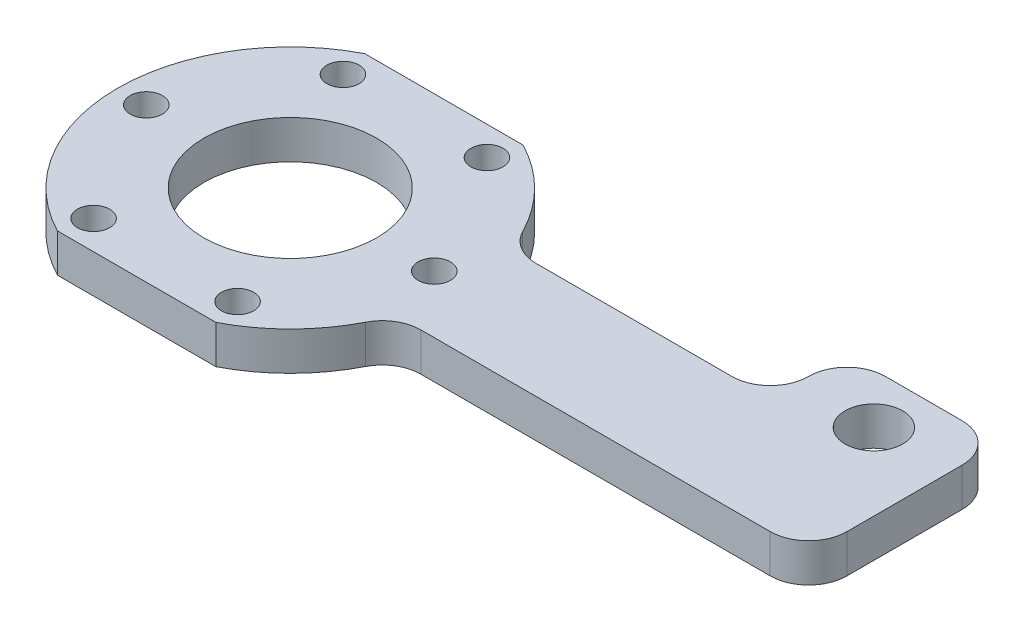
ISO-10303-21;
HEADER;
FILE_DESCRIPTION(('STEP AP214'),'2;1');
FILE_NAME('part.step','',(''),(''),'','','');
FILE_SCHEMA(('AUTOMOTIVE_DESIGN { 1 0 10303 214 1 1 1 1 }'));
ENDSEC;
DATA;
#1=APPLICATION_CONTEXT('core data for automotive mechanical design processes');
#2=APPLICATION_PROTOCOL_DEFINITION('international standard','automotive_design',2000,#1);
#3=PRODUCT_CONTEXT('',#1,'mechanical');
#4=PRODUCT('Part','Part','',(#3));
#5=PRODUCT_RELATED_PRODUCT_CATEGORY('part','',(#4));
#6=PRODUCT_DEFINITION_FORMATION('','',#4);
#7=PRODUCT_DEFINITION_CONTEXT('part definition',#1,'design');
#8=PRODUCT_DEFINITION('design','',#6,#7);
#9=PRODUCT_DEFINITION_SHAPE('','',#8);
#10=(LENGTH_UNIT() NAMED_UNIT(*) SI_UNIT(.MILLI.,.METRE.));
#11=(NAMED_UNIT(*) PLANE_ANGLE_UNIT() SI_UNIT($,.RADIAN.));
#12=(NAMED_UNIT(*) SI_UNIT($,.STERADIAN.) SOLID_ANGLE_UNIT());
#13=UNCERTAINTY_MEASURE_WITH_UNIT(LENGTH_MEASURE(1.E-05),#10,'distance_accuracy_value','');
#14=(GEOMETRIC_REPRESENTATION_CONTEXT(3) GLOBAL_UNCERTAINTY_ASSIGNED_CONTEXT((#13)) GLOBAL_UNIT_ASSIGNED_CONTEXT((#10,
#11,#12)) REPRESENTATION_CONTEXT('',''));
#15=CARTESIAN_POINT('',(0.,0.,0.));
#16=DIRECTION('',(0.,0.,1.));
#17=DIRECTION('',(1.,0.,0.));
#18=AXIS2_PLACEMENT_3D('',#15,#16,#17);
#19=CARTESIAN_POINT('',(0.,6.35,0.));
#20=DIRECTION('',(0.,-1.,0.));
#21=DIRECTION('',(0.,0.,-1.));
#22=AXIS2_PLACEMENT_3D('',#19,#20,#21);
#23=CYLINDRICAL_SURFACE('',#22,28.575);
#24=CARTESIAN_POINT('',(0.,6.35,0.));
#25=DIRECTION('',(0.,1.,0.));
#26=DIRECTION('',(0.,0.,1.));
#27=AXIS2_PLACEMENT_3D('',#24,#25,#26);
#28=CIRCLE('',#27,28.575);
#29=CARTESIAN_POINT('',(-13.0908603613361,6.35,-25.4));
#30=VERTEX_POINT('',#29);
#31=CARTESIAN_POINT('',(-13.0908603613368,6.35,25.3999999999996));
#32=VERTEX_POINT('',#31);
#33=EDGE_CURVE('E163',#30,#32,#28,.T.);
#34=ORIENTED_EDGE('',*,*,#33,.F.);
#35=DIRECTION('',(0.,-1.,0.));
#36=VECTOR('',#35,1.);
#37=CARTESIAN_POINT('',(-13.0908603613361,6.35,-25.4));
#38=LINE('',#37,#36);
#39=CARTESIAN_POINT('',(-13.0908603613361,0.,-25.4));
#40=VERTEX_POINT('',#39);
#41=EDGE_CURVE('E245',#30,#40,#38,.T.);
#42=ORIENTED_EDGE('',*,*,#41,.T.);
#43=CARTESIAN_POINT('',(0.,0.,0.));
#44=DIRECTION('',(0.,1.,0.));
#45=DIRECTION('',(0.,0.,1.));
#46=AXIS2_PLACEMENT_3D('',#43,#44,#45);
#47=CIRCLE('',#46,28.575);
#48=CARTESIAN_POINT('',(-13.0908603613368,0.,25.3999999999996));
#49=VERTEX_POINT('',#48);
#50=EDGE_CURVE('E174',#40,#49,#47,.T.);
#51=ORIENTED_EDGE('',*,*,#50,.T.);
#52=DIRECTION('',(0.,-1.,0.));
#53=VECTOR('',#52,1.);
#54=CARTESIAN_POINT('',(-13.0908603613368,6.35,25.3999999999996));
#55=LINE('',#54,#53);
#56=EDGE_CURVE('E53',#49,#32,#55,.F.);
#57=ORIENTED_EDGE('',*,*,#56,.T.);
#58=EDGE_LOOP('',(#34,#42,#51,#57));
#59=FACE_BOUND('',#58,.T.);
#60=ADVANCED_FACE('F38',(#59),#23,.T.);
#61=CARTESIAN_POINT('',(13.0908603613353,6.35,25.4000000000004));
#62=VERTEX_POINT('',#61);
#63=CARTESIAN_POINT('',(25.4524252363743,6.35,12.9886363636364));
#64=VERTEX_POINT('',#63);
#65=EDGE_CURVE('E160',#62,#64,#28,.T.);
#66=ORIENTED_EDGE('',*,*,#65,.F.);
#67=DIRECTION('',(0.,-1.,0.));
#68=VECTOR('',#67,1.);
#69=CARTESIAN_POINT('',(13.0908603613354,6.35,25.4000000000004));
#70=LINE('',#69,#68);
#71=CARTESIAN_POINT('',(13.0908603613353,0.,25.4000000000004));
#72=VERTEX_POINT('',#71);
#73=EDGE_CURVE('E147',#62,#72,#70,.T.);
#74=ORIENTED_EDGE('',*,*,#73,.T.);
#75=CARTESIAN_POINT('',(25.4524252363743,0.,12.9886363636364));
#76=VERTEX_POINT('',#75);
#77=EDGE_CURVE('E176',#72,#76,#47,.T.);
#78=ORIENTED_EDGE('',*,*,#77,.T.);
#79=DIRECTION('',(0.,-1.,0.));
#80=VECTOR('',#79,1.);
#81=CARTESIAN_POINT('',(25.4524252363743,6.35,12.9886363636364));
#82=LINE('',#81,#80);
#83=EDGE_CURVE('E168',#76,#64,#82,.F.);
#84=ORIENTED_EDGE('',*,*,#83,.T.);
#85=EDGE_LOOP('',(#66,#74,#78,#84));
#86=FACE_BOUND('',#85,.T.);
#87=ADVANCED_FACE('F166',(#86),#23,.T.);
#88=CARTESIAN_POINT('',(25.4524252363743,0.,-12.9886363636364));
#89=VERTEX_POINT('',#88);
#90=CARTESIAN_POINT('',(13.0908603613361,0.,-25.4));
#91=VERTEX_POINT('',#90);
#92=EDGE_CURVE('E170',#89,#91,#47,.T.);
#93=ORIENTED_EDGE('',*,*,#92,.T.);
#94=DIRECTION('',(0.,-1.,0.));
#95=VECTOR('',#94,1.);
#96=CARTESIAN_POINT('',(13.0908603613361,6.35,-25.4));
#97=LINE('',#96,#95);
#98=CARTESIAN_POINT('',(13.0908603613361,6.35,-25.4));
#99=VERTEX_POINT('',#98);
#100=EDGE_CURVE('E61',#91,#99,#97,.F.);
#101=ORIENTED_EDGE('',*,*,#100,.T.);
#102=CARTESIAN_POINT('',(25.4524252363743,6.35,-12.9886363636364));
#103=VERTEX_POINT('',#102);
#104=EDGE_CURVE('E172',#103,#99,#28,.T.);
#105=ORIENTED_EDGE('',*,*,#104,.F.);
#106=DIRECTION('',(0.,-1.,0.));
#107=VECTOR('',#106,1.);
#108=CARTESIAN_POINT('',(25.4524252363743,6.35,-12.9886363636364));
#109=LINE('',#108,#107);
#110=EDGE_CURVE('E192',#103,#89,#109,.T.);
#111=ORIENTED_EDGE('',*,*,#110,.T.);
#112=EDGE_LOOP('',(#93,#101,#105,#111));
#113=FACE_BOUND('',#112,.T.);
#114=ADVANCED_FACE('F334',(#113),#23,.T.);
#115=CARTESIAN_POINT('',(0.,6.35,0.));
#116=DIRECTION('',(0.,1.,0.));
#117=DIRECTION('',(0.,0.,1.));
#118=AXIS2_PLACEMENT_3D('',#115,#116,#117);
#119=PLANE('',#118);
#120=DIRECTION('',(1.,0.,0.));
#121=VECTOR('',#120,1.);
#122=CARTESIAN_POINT('',(-38.2721885442485,6.35,-25.4));
#123=LINE('',#122,#121);
#124=EDGE_CURVE('E164',#30,#99,#123,.T.);
#125=ORIENTED_EDGE('',*,*,#124,.F.);
#126=ORIENTED_EDGE('',*,*,#33,.T.);
#127=DIRECTION('',(-1.,0.,0.));
#128=VECTOR('',#127,1.);
#129=CARTESIAN_POINT('',(-38.2721885442492,6.35,25.3999999999989));
#130=LINE('',#129,#128);
#131=EDGE_CURVE('E150',#62,#32,#130,.T.);
#132=ORIENTED_EDGE('',*,*,#131,.F.);
#133=ORIENTED_EDGE('',*,*,#65,.T.);
#134=CARTESIAN_POINT('',(31.1085197333464,6.35,15.875));
#135=DIRECTION('',(0.,1.,0.));
#136=DIRECTION('',(0.,0.,1.));
#137=AXIS2_PLACEMENT_3D('',#134,#135,#136);
#138=CIRCLE('',#137,6.35);
#139=CARTESIAN_POINT('',(31.1085197333464,6.34999999999999,9.525));
#140=VERTEX_POINT('',#139);
#141=EDGE_CURVE('E232',#64,#140,#138,.F.);
#142=ORIENTED_EDGE('',*,*,#141,.T.);
#143=DIRECTION('',(1.,0.,0.));
#144=VECTOR('',#143,1.);
#145=CARTESIAN_POINT('',(26.9407683632075,6.34999999999999,9.525));
#146=LINE('',#145,#144);
#147=CARTESIAN_POINT('',(88.9,6.34999999999999,9.525));
#148=VERTEX_POINT('',#147);
#149=EDGE_CURVE('E298',#140,#148,#146,.T.);
#150=ORIENTED_EDGE('',*,*,#149,.T.);
#151=CARTESIAN_POINT('',(88.9,6.34999999999999,3.175));
#152=DIRECTION('',(0.,1.,0.));
#153=DIRECTION('',(0.,0.,1.));
#154=AXIS2_PLACEMENT_3D('',#151,#152,#153);
#155=CIRCLE('',#154,6.35);
#156=CARTESIAN_POINT('',(95.25,6.34999999999999,3.175));
#157=VERTEX_POINT('',#156);
#158=EDGE_CURVE('E223',#148,#157,#155,.T.);
#159=ORIENTED_EDGE('',*,*,#158,.T.);
#160=DIRECTION('',(0.,0.,-1.));
#161=VECTOR('',#160,1.);
#162=CARTESIAN_POINT('',(95.25,6.34999999999999,9.525));
#163=LINE('',#162,#161);
#164=CARTESIAN_POINT('',(95.25,6.34999999999999,-15.875));
#165=VERTEX_POINT('',#164);
#166=EDGE_CURVE('E301',#157,#165,#163,.T.);
#167=ORIENTED_EDGE('',*,*,#166,.T.);
#168=CARTESIAN_POINT('',(88.9,6.34999999999999,-15.875));
#169=DIRECTION('',(0.,1.,0.));
#170=DIRECTION('',(0.,0.,1.));
#171=AXIS2_PLACEMENT_3D('',#168,#169,#170);
#172=CIRCLE('',#171,6.35);
#173=CARTESIAN_POINT('',(88.9,6.35,-22.225));
#174=VERTEX_POINT('',#173);
#175=EDGE_CURVE('E219',#165,#174,#172,.T.);
#176=ORIENTED_EDGE('',*,*,#175,.T.);
#177=DIRECTION('',(-1.,0.,0.));
#178=VECTOR('',#177,1.);
#179=CARTESIAN_POINT('',(95.25,6.35,-22.225));
#180=LINE('',#179,#178);
#181=CARTESIAN_POINT('',(76.2,6.35,-22.225));
#182=VERTEX_POINT('',#181);
#183=EDGE_CURVE('E319',#174,#182,#180,.T.);
#184=ORIENTED_EDGE('',*,*,#183,.T.);
#185=CARTESIAN_POINT('',(76.2,6.35,-15.875));
#186=DIRECTION('',(0.,1.,0.));
#187=DIRECTION('',(0.,0.,1.));
#188=AXIS2_PLACEMENT_3D('',#185,#186,#187);
#189=CIRCLE('',#188,6.35);
#190=CARTESIAN_POINT('',(69.85,6.35,-15.875));
#191=VERTEX_POINT('',#190);
#192=EDGE_CURVE('E221',#182,#191,#189,.T.);
#193=ORIENTED_EDGE('',*,*,#192,.T.);
#194=CARTESIAN_POINT('',(63.5,6.35,-15.875));
#195=DIRECTION('',(0.,1.,0.));
#196=DIRECTION('',(0.,0.,1.));
#197=AXIS2_PLACEMENT_3D('',#194,#195,#196);
#198=CIRCLE('',#197,6.35);
#199=CARTESIAN_POINT('',(63.5,6.34999999999999,-9.52500000000001));
#200=VERTEX_POINT('',#199);
#201=EDGE_CURVE('E238',#191,#200,#198,.F.);
#202=ORIENTED_EDGE('',*,*,#201,.T.);
#203=DIRECTION('',(-1.,0.,0.));
#204=VECTOR('',#203,1.);
#205=CARTESIAN_POINT('',(26.9407683632075,6.34999999999999,-9.52500000000001));
#206=LINE('',#205,#204);
#207=CARTESIAN_POINT('',(31.1085197333464,6.34999999999999,-9.52500000000001));
#208=VERTEX_POINT('',#207);
#209=EDGE_CURVE('E295',#200,#208,#206,.T.);
#210=ORIENTED_EDGE('',*,*,#209,.T.);
#211=CARTESIAN_POINT('',(31.1085197333464,6.35,-15.875));
#212=DIRECTION('',(0.,1.,0.));
#213=DIRECTION('',(0.,0.,1.));
#214=AXIS2_PLACEMENT_3D('',#211,#212,#213);
#215=CIRCLE('',#214,6.35);
#216=EDGE_CURVE('E236',#208,#103,#215,.F.);
#217=ORIENTED_EDGE('',*,*,#216,.T.);
#218=ORIENTED_EDGE('',*,*,#104,.T.);
#219=EDGE_LOOP('',(#125,#126,#132,#133,#142,#150,#159,#167,#176,#184,#193,#202,#210,#217,#218));
#220=FACE_BOUND('',#219,.T.);
#221=CARTESIAN_POINT('',(82.55,6.35,-13.97));
#222=DIRECTION('',(0.,1.,0.));
#223=DIRECTION('',(0.,0.,1.));
#224=AXIS2_PLACEMENT_3D('',#221,#222,#223);
#225=CIRCLE('',#224,4.7625);
#226=CARTESIAN_POINT('',(82.55,6.35,-9.2075));
#227=VERTEX_POINT('',#226);
#228=EDGE_CURVE('E322',#227,#227,#225,.T.);
#229=ORIENTED_EDGE('',*,*,#228,.F.);
#230=EDGE_LOOP('',(#229));
#231=FACE_BOUND('',#230,.T.);
#232=CARTESIAN_POINT('',(-23.8124999999994,6.35,2.27248775352962E-12));
#233=DIRECTION('',(0.,1.,0.));
#234=DIRECTION('',(0.,0.,1.));
#235=AXIS2_PLACEMENT_3D('',#232,#233,#234);
#236=CIRCLE('',#235,2.667);
#237=CARTESIAN_POINT('',(-23.8124999999994,6.35,2.66700000000227));
#238=VERTEX_POINT('',#237);
#239=EDGE_CURVE('E283',#238,#238,#236,.T.);
#240=ORIENTED_EDGE('',*,*,#239,.F.);
#241=EDGE_LOOP('',(#240));
#242=FACE_BOUND('',#241,.T.);
#243=CARTESIAN_POINT('',(11.9062500000023,6.35,20.6222299276175));
#244=DIRECTION('',(0.,1.,0.));
#245=DIRECTION('',(0.,0.,1.));
#246=AXIS2_PLACEMENT_3D('',#243,#244,#245);
#247=CIRCLE('',#246,2.667);
#248=CARTESIAN_POINT('',(11.9062500000023,6.35,23.2892299276175));
#249=VERTEX_POINT('',#248);
#250=EDGE_CURVE('E271',#249,#249,#247,.T.);
#251=ORIENTED_EDGE('',*,*,#250,.F.);
#252=EDGE_LOOP('',(#251));
#253=FACE_BOUND('',#252,.T.);
#254=CARTESIAN_POINT('',(11.9062499999999,6.35,-20.622229927617));
#255=DIRECTION('',(0.,1.,0.));
#256=DIRECTION('',(0.,0.,1.));
#257=AXIS2_PLACEMENT_3D('',#254,#255,#256);
#258=CIRCLE('',#257,2.667);
#259=CARTESIAN_POINT('',(11.9062499999999,6.35,-17.955229927617));
#260=VERTEX_POINT('',#259);
#261=EDGE_CURVE('E260',#260,#260,#258,.T.);
#262=ORIENTED_EDGE('',*,*,#261,.F.);
#263=EDGE_LOOP('',(#262));
#264=FACE_BOUND('',#263,.T.);
#265=CARTESIAN_POINT('',(0.,6.35,0.));
#266=DIRECTION('',(0.,1.,0.));
#267=DIRECTION('',(0.,0.,1.));
#268=AXIS2_PLACEMENT_3D('',#265,#266,#267);
#269=CIRCLE('',#268,14.2875);
#270=CARTESIAN_POINT('',(0.,6.35,14.2875));
#271=VERTEX_POINT('',#270);
#272=EDGE_CURVE('E253',#271,#271,#269,.T.);
#273=ORIENTED_EDGE('',*,*,#272,.F.);
#274=EDGE_LOOP('',(#273));
#275=FACE_BOUND('',#274,.T.);
#276=CARTESIAN_POINT('',(23.8125000000013,6.35,-4.05925293378573E-13));
#277=DIRECTION('',(0.,1.,0.));
#278=DIRECTION('',(0.,0.,1.));
#279=AXIS2_PLACEMENT_3D('',#276,#277,#278);
#280=CIRCLE('',#279,2.667);
#281=CARTESIAN_POINT('',(23.8125000000013,6.35,2.6669999999996));
#282=VERTEX_POINT('',#281);
#283=EDGE_CURVE('E265',#282,#282,#280,.T.);
#284=ORIENTED_EDGE('',*,*,#283,.F.);
#285=EDGE_LOOP('',(#284));
#286=FACE_BOUND('',#285,.T.);
#287=CARTESIAN_POINT('',(-11.9062499999981,6.35,20.6222299276188));
#288=DIRECTION('',(0.,1.,0.));
#289=DIRECTION('',(0.,0.,1.));
#290=AXIS2_PLACEMENT_3D('',#287,#288,#289);
#291=CIRCLE('',#290,2.667);
#292=CARTESIAN_POINT('',(-11.9062499999981,6.35,23.2892299276188));
#293=VERTEX_POINT('',#292);
#294=EDGE_CURVE('E277',#293,#293,#291,.T.);
#295=ORIENTED_EDGE('',*,*,#294,.F.);
#296=EDGE_LOOP('',(#295));
#297=FACE_BOUND('',#296,.T.);
#298=CARTESIAN_POINT('',(-11.9062500000004,6.35,-20.6222299276156));
#299=DIRECTION('',(0.,1.,0.));
#300=DIRECTION('',(0.,0.,1.));
#301=AXIS2_PLACEMENT_3D('',#298,#299,#300);
#302=CIRCLE('',#301,2.667);
#303=CARTESIAN_POINT('',(-11.9062500000004,6.35,-17.9552299276156));
#304=VERTEX_POINT('',#303);
#305=EDGE_CURVE('E289',#304,#304,#302,.T.);
#306=ORIENTED_EDGE('',*,*,#305,.F.);
#307=EDGE_LOOP('',(#306));
#308=FACE_BOUND('',#307,.T.);
#309=ADVANCED_FACE('F158',(#220,#231,#242,#253,#264,#275,#286,#297,#308),#119,.T.);
#310=CARTESIAN_POINT('',(0.,0.,0.));
#311=DIRECTION('',(0.,1.,0.));
#312=DIRECTION('',(0.,0.,1.));
#313=AXIS2_PLACEMENT_3D('',#310,#311,#312);
#314=PLANE('',#313);
#315=CARTESIAN_POINT('',(82.55,0.,-13.97));
#316=DIRECTION('',(0.,1.,0.));
#317=DIRECTION('',(0.,0.,1.));
#318=AXIS2_PLACEMENT_3D('',#315,#316,#317);
#319=CIRCLE('',#318,4.7625);
#320=CARTESIAN_POINT('',(82.55,0.,-9.2075));
#321=VERTEX_POINT('',#320);
#322=EDGE_CURVE('E244',#321,#321,#319,.T.);
#323=ORIENTED_EDGE('',*,*,#322,.T.);
#324=EDGE_LOOP('',(#323));
#325=FACE_BOUND('',#324,.T.);
#326=ORIENTED_EDGE('',*,*,#50,.F.);
#327=DIRECTION('',(1.,0.,0.));
#328=VECTOR('',#327,1.);
#329=CARTESIAN_POINT('',(0.,0.,-25.4));
#330=LINE('',#329,#328);
#331=EDGE_CURVE('E11',#40,#91,#330,.T.);
#332=ORIENTED_EDGE('',*,*,#331,.T.);
#333=ORIENTED_EDGE('',*,*,#92,.F.);
#334=CARTESIAN_POINT('',(31.1085197333464,0.,-15.875));
#335=DIRECTION('',(0.,1.,0.));
#336=DIRECTION('',(0.,0.,1.));
#337=AXIS2_PLACEMENT_3D('',#334,#335,#336);
#338=CIRCLE('',#337,6.35);
#339=CARTESIAN_POINT('',(31.1085197333464,0.,-9.52500000000001));
#340=VERTEX_POINT('',#339);
#341=EDGE_CURVE('E234',#89,#340,#338,.T.);
#342=ORIENTED_EDGE('',*,*,#341,.T.);
#343=DIRECTION('',(-1.,0.,0.));
#344=VECTOR('',#343,1.);
#345=CARTESIAN_POINT('',(26.9407683632075,0.,-9.52500000000001));
#346=LINE('',#345,#344);
#347=CARTESIAN_POINT('',(63.5,0.,-9.52500000000001));
#348=VERTEX_POINT('',#347);
#349=EDGE_CURVE('E312',#348,#340,#346,.T.);
#350=ORIENTED_EDGE('',*,*,#349,.F.);
#351=CARTESIAN_POINT('',(63.5,0.,-15.875));
#352=DIRECTION('',(0.,1.,0.));
#353=DIRECTION('',(0.,0.,1.));
#354=AXIS2_PLACEMENT_3D('',#351,#352,#353);
#355=CIRCLE('',#354,6.35);
#356=CARTESIAN_POINT('',(69.85,0.,-15.875));
#357=VERTEX_POINT('',#356);
#358=EDGE_CURVE('E240',#348,#357,#355,.T.);
#359=ORIENTED_EDGE('',*,*,#358,.T.);
#360=CARTESIAN_POINT('',(76.2,0.,-15.875));
#361=DIRECTION('',(0.,1.,0.));
#362=DIRECTION('',(0.,0.,1.));
#363=AXIS2_PLACEMENT_3D('',#360,#361,#362);
#364=CIRCLE('',#363,6.35);
#365=CARTESIAN_POINT('',(76.2,0.,-22.225));
#366=VERTEX_POINT('',#365);
#367=EDGE_CURVE('E214',#357,#366,#364,.F.);
#368=ORIENTED_EDGE('',*,*,#367,.T.);
#369=DIRECTION('',(1.,0.,0.));
#370=VECTOR('',#369,1.);
#371=CARTESIAN_POINT('',(95.25,0.,-22.225));
#372=LINE('',#371,#370);
#373=CARTESIAN_POINT('',(88.9,0.,-22.225));
#374=VERTEX_POINT('',#373);
#375=EDGE_CURVE('E313',#366,#374,#372,.T.);
#376=ORIENTED_EDGE('',*,*,#375,.T.);
#377=CARTESIAN_POINT('',(88.9,0.,-15.875));
#378=DIRECTION('',(0.,1.,0.));
#379=DIRECTION('',(0.,0.,1.));
#380=AXIS2_PLACEMENT_3D('',#377,#378,#379);
#381=CIRCLE('',#380,6.35);
#382=CARTESIAN_POINT('',(95.25,0.,-15.875));
#383=VERTEX_POINT('',#382);
#384=EDGE_CURVE('E211',#374,#383,#381,.F.);
#385=ORIENTED_EDGE('',*,*,#384,.T.);
#386=DIRECTION('',(0.,0.,-1.));
#387=VECTOR('',#386,1.);
#388=CARTESIAN_POINT('',(95.25,0.,9.525));
#389=LINE('',#388,#387);
#390=CARTESIAN_POINT('',(95.25,0.,3.175));
#391=VERTEX_POINT('',#390);
#392=EDGE_CURVE('E308',#391,#383,#389,.T.);
#393=ORIENTED_EDGE('',*,*,#392,.F.);
#394=CARTESIAN_POINT('',(88.9,0.,3.175));
#395=DIRECTION('',(0.,1.,0.));
#396=DIRECTION('',(0.,0.,1.));
#397=AXIS2_PLACEMENT_3D('',#394,#395,#396);
#398=CIRCLE('',#397,6.35);
#399=CARTESIAN_POINT('',(88.9,0.,9.525));
#400=VERTEX_POINT('',#399);
#401=EDGE_CURVE('E216',#391,#400,#398,.F.);
#402=ORIENTED_EDGE('',*,*,#401,.T.);
#403=DIRECTION('',(1.,0.,0.));
#404=VECTOR('',#403,1.);
#405=CARTESIAN_POINT('',(26.9407683632075,0.,9.525));
#406=LINE('',#405,#404);
#407=CARTESIAN_POINT('',(31.1085197333464,0.,9.525));
#408=VERTEX_POINT('',#407);
#409=EDGE_CURVE('E302',#408,#400,#406,.T.);
#410=ORIENTED_EDGE('',*,*,#409,.F.);
#411=CARTESIAN_POINT('',(31.1085197333464,0.,15.875));
#412=DIRECTION('',(0.,1.,0.));
#413=DIRECTION('',(0.,0.,1.));
#414=AXIS2_PLACEMENT_3D('',#411,#412,#413);
#415=CIRCLE('',#414,6.35);
#416=EDGE_CURVE('E229',#408,#76,#415,.T.);
#417=ORIENTED_EDGE('',*,*,#416,.T.);
#418=ORIENTED_EDGE('',*,*,#77,.F.);
#419=DIRECTION('',(-1.,0.,0.));
#420=VECTOR('',#419,1.);
#421=CARTESIAN_POINT('',(-7.17755863153344E-13,0.,25.4));
#422=LINE('',#421,#420);
#423=EDGE_CURVE('E46',#72,#49,#422,.T.);
#424=ORIENTED_EDGE('',*,*,#423,.T.);
#425=EDGE_LOOP('',(#326,#332,#333,#342,#350,#359,#368,#376,#385,#393,#402,#410,#417,#418,#424));
#426=FACE_BOUND('',#425,.T.);
#427=CARTESIAN_POINT('',(0.,0.,0.));
#428=DIRECTION('',(0.,1.,0.));
#429=DIRECTION('',(0.,0.,1.));
#430=AXIS2_PLACEMENT_3D('',#427,#428,#429);
#431=CIRCLE('',#430,14.2875);
#432=CARTESIAN_POINT('',(0.,0.,14.2875));
#433=VERTEX_POINT('',#432);
#434=EDGE_CURVE('E255',#433,#433,#431,.T.);
#435=ORIENTED_EDGE('',*,*,#434,.T.);
#436=EDGE_LOOP('',(#435));
#437=FACE_BOUND('',#436,.T.);
#438=CARTESIAN_POINT('',(11.9062499999999,0.,-20.622229927617));
#439=DIRECTION('',(0.,1.,0.));
#440=DIRECTION('',(0.,0.,1.));
#441=AXIS2_PLACEMENT_3D('',#438,#439,#440);
#442=CIRCLE('',#441,2.667);
#443=CARTESIAN_POINT('',(11.9062499999999,0.,-17.955229927617));
#444=VERTEX_POINT('',#443);
#445=EDGE_CURVE('E262',#444,#444,#442,.T.);
#446=ORIENTED_EDGE('',*,*,#445,.T.);
#447=EDGE_LOOP('',(#446));
#448=FACE_BOUND('',#447,.T.);
#449=CARTESIAN_POINT('',(23.8125000000013,0.,-4.05925293378573E-13));
#450=DIRECTION('',(0.,1.,0.));
#451=DIRECTION('',(0.,0.,1.));
#452=AXIS2_PLACEMENT_3D('',#449,#450,#451);
#453=CIRCLE('',#452,2.667);
#454=CARTESIAN_POINT('',(23.8125000000013,0.,2.6669999999996));
#455=VERTEX_POINT('',#454);
#456=EDGE_CURVE('E268',#455,#455,#453,.T.);
#457=ORIENTED_EDGE('',*,*,#456,.T.);
#458=EDGE_LOOP('',(#457));
#459=FACE_BOUND('',#458,.T.);
#460=CARTESIAN_POINT('',(11.9062500000023,0.,20.6222299276175));
#461=DIRECTION('',(0.,1.,0.));
#462=DIRECTION('',(0.,0.,1.));
#463=AXIS2_PLACEMENT_3D('',#460,#461,#462);
#464=CIRCLE('',#463,2.667);
#465=CARTESIAN_POINT('',(11.9062500000023,0.,23.2892299276175));
#466=VERTEX_POINT('',#465);
#467=EDGE_CURVE('E274',#466,#466,#464,.T.);
#468=ORIENTED_EDGE('',*,*,#467,.T.);
#469=EDGE_LOOP('',(#468));
#470=FACE_BOUND('',#469,.T.);
#471=CARTESIAN_POINT('',(-11.9062499999981,0.,20.6222299276188));
#472=DIRECTION('',(0.,1.,0.));
#473=DIRECTION('',(0.,0.,1.));
#474=AXIS2_PLACEMENT_3D('',#471,#472,#473);
#475=CIRCLE('',#474,2.667);
#476=CARTESIAN_POINT('',(-11.9062499999981,0.,23.2892299276188));
#477=VERTEX_POINT('',#476);
#478=EDGE_CURVE('E280',#477,#477,#475,.T.);
#479=ORIENTED_EDGE('',*,*,#478,.T.);
#480=EDGE_LOOP('',(#479));
#481=FACE_BOUND('',#480,.T.);
#482=CARTESIAN_POINT('',(-23.8124999999994,0.,2.27248775352962E-12));
#483=DIRECTION('',(0.,1.,0.));
#484=DIRECTION('',(0.,0.,1.));
#485=AXIS2_PLACEMENT_3D('',#482,#483,#484);
#486=CIRCLE('',#485,2.667);
#487=CARTESIAN_POINT('',(-23.8124999999994,0.,2.66700000000227));
#488=VERTEX_POINT('',#487);
#489=EDGE_CURVE('E286',#488,#488,#486,.T.);
#490=ORIENTED_EDGE('',*,*,#489,.T.);
#491=EDGE_LOOP('',(#490));
#492=FACE_BOUND('',#491,.T.);
#493=CARTESIAN_POINT('',(-11.9062500000004,0.,-20.6222299276156));
#494=DIRECTION('',(0.,1.,0.));
#495=DIRECTION('',(0.,0.,1.));
#496=AXIS2_PLACEMENT_3D('',#493,#494,#495);
#497=CIRCLE('',#496,2.667);
#498=CARTESIAN_POINT('',(-11.9062500000004,0.,-17.9552299276156));
#499=VERTEX_POINT('',#498);
#500=EDGE_CURVE('E292',#499,#499,#497,.T.);
#501=ORIENTED_EDGE('',*,*,#500,.T.);
#502=EDGE_LOOP('',(#501));
#503=FACE_BOUND('',#502,.T.);
#504=ADVANCED_FACE('F249',(#325,#426,#437,#448,#459,#470,#481,#492,#503),#314,.F.);
#505=CARTESIAN_POINT('',(0.,6.35,0.));
#506=DIRECTION('',(0.,-1.,0.));
#507=DIRECTION('',(0.,0.,-1.));
#508=AXIS2_PLACEMENT_3D('',#505,#506,#507);
#509=CYLINDRICAL_SURFACE('',#508,14.2875);
#510=ORIENTED_EDGE('',*,*,#272,.T.);
#511=EDGE_LOOP('',(#510));
#512=FACE_BOUND('',#511,.T.);
#513=ORIENTED_EDGE('',*,*,#434,.F.);
#514=EDGE_LOOP('',(#513));
#515=FACE_BOUND('',#514,.T.);
#516=ADVANCED_FACE('F400',(#512,#515),#509,.F.);
#517=CARTESIAN_POINT('',(11.9062499999999,6.35,-20.622229927617));
#518=DIRECTION('',(0.,-1.,0.));
#519=DIRECTION('',(0.,0.,-1.));
#520=AXIS2_PLACEMENT_3D('',#517,#518,#519);
#521=CYLINDRICAL_SURFACE('',#520,2.667);
#522=ORIENTED_EDGE('',*,*,#261,.T.);
#523=EDGE_LOOP('',(#522));
#524=FACE_BOUND('',#523,.T.);
#525=ORIENTED_EDGE('',*,*,#445,.F.);
#526=EDGE_LOOP('',(#525));
#527=FACE_BOUND('',#526,.T.);
#528=ADVANCED_FACE('F405',(#524,#527),#521,.F.);
#529=CARTESIAN_POINT('',(23.8125000000013,6.35,-4.05925293378573E-13));
#530=DIRECTION('',(0.,-1.,0.));
#531=DIRECTION('',(0.,0.,-1.));
#532=AXIS2_PLACEMENT_3D('',#529,#530,#531);
#533=CYLINDRICAL_SURFACE('',#532,2.667);
#534=ORIENTED_EDGE('',*,*,#283,.T.);
#535=EDGE_LOOP('',(#534));
#536=FACE_BOUND('',#535,.T.);
#537=ORIENTED_EDGE('',*,*,#456,.F.);
#538=EDGE_LOOP('',(#537));
#539=FACE_BOUND('',#538,.T.);
#540=ADVANCED_FACE('F408',(#536,#539),#533,.F.);
#541=CARTESIAN_POINT('',(11.9062500000023,6.35,20.6222299276175));
#542=DIRECTION('',(0.,-1.,0.));
#543=DIRECTION('',(0.,0.,-1.));
#544=AXIS2_PLACEMENT_3D('',#541,#542,#543);
#545=CYLINDRICAL_SURFACE('',#544,2.667);
#546=ORIENTED_EDGE('',*,*,#250,.T.);
#547=EDGE_LOOP('',(#546));
#548=FACE_BOUND('',#547,.T.);
#549=ORIENTED_EDGE('',*,*,#467,.F.);
#550=EDGE_LOOP('',(#549));
#551=FACE_BOUND('',#550,.T.);
#552=ADVANCED_FACE('F412',(#548,#551),#545,.F.);
#553=CARTESIAN_POINT('',(-11.9062499999981,6.35,20.6222299276188));
#554=DIRECTION('',(0.,-1.,0.));
#555=DIRECTION('',(0.,0.,-1.));
#556=AXIS2_PLACEMENT_3D('',#553,#554,#555);
#557=CYLINDRICAL_SURFACE('',#556,2.667);
#558=ORIENTED_EDGE('',*,*,#294,.T.);
#559=EDGE_LOOP('',(#558));
#560=FACE_BOUND('',#559,.T.);
#561=ORIENTED_EDGE('',*,*,#478,.F.);
#562=EDGE_LOOP('',(#561));
#563=FACE_BOUND('',#562,.T.);
#564=ADVANCED_FACE('F416',(#560,#563),#557,.F.);
#565=CARTESIAN_POINT('',(-23.8124999999994,6.35,2.27248775352962E-12));
#566=DIRECTION('',(0.,-1.,0.));
#567=DIRECTION('',(0.,0.,-1.));
#568=AXIS2_PLACEMENT_3D('',#565,#566,#567);
#569=CYLINDRICAL_SURFACE('',#568,2.667);
#570=ORIENTED_EDGE('',*,*,#239,.T.);
#571=EDGE_LOOP('',(#570));
#572=FACE_BOUND('',#571,.T.);
#573=ORIENTED_EDGE('',*,*,#489,.F.);
#574=EDGE_LOOP('',(#573));
#575=FACE_BOUND('',#574,.T.);
#576=ADVANCED_FACE('F420',(#572,#575),#569,.F.);
#577=CARTESIAN_POINT('',(-11.9062500000004,6.35,-20.6222299276156));
#578=DIRECTION('',(0.,-1.,0.));
#579=DIRECTION('',(0.,0.,-1.));
#580=AXIS2_PLACEMENT_3D('',#577,#578,#579);
#581=CYLINDRICAL_SURFACE('',#580,2.667);
#582=ORIENTED_EDGE('',*,*,#305,.T.);
#583=EDGE_LOOP('',(#582));
#584=FACE_BOUND('',#583,.T.);
#585=ORIENTED_EDGE('',*,*,#500,.F.);
#586=EDGE_LOOP('',(#585));
#587=FACE_BOUND('',#586,.T.);
#588=ADVANCED_FACE('F424',(#584,#587),#581,.F.);
#589=CARTESIAN_POINT('',(95.25,77.2658207088445,9.525));
#590=DIRECTION('',(-1.,0.,0.));
#591=DIRECTION('',(0.,0.,1.));
#592=AXIS2_PLACEMENT_3D('',#589,#590,#591);
#593=PLANE('',#592);
#594=ORIENTED_EDGE('',*,*,#166,.F.);
#595=DIRECTION('',(0.,-1.,0.));
#596=VECTOR('',#595,1.);
#597=CARTESIAN_POINT('',(95.25,77.2658207088445,3.175));
#598=LINE('',#597,#596);
#599=EDGE_CURVE('E207',#157,#391,#598,.T.);
#600=ORIENTED_EDGE('',*,*,#599,.T.);
#601=ORIENTED_EDGE('',*,*,#392,.T.);
#602=DIRECTION('',(0.,1.,0.));
#603=VECTOR('',#602,1.);
#604=CARTESIAN_POINT('',(95.25,6.34999999999999,-15.875));
#605=LINE('',#604,#603);
#606=EDGE_CURVE('E203',#383,#165,#605,.T.);
#607=ORIENTED_EDGE('',*,*,#606,.T.);
#608=EDGE_LOOP('',(#594,#600,#601,#607));
#609=FACE_BOUND('',#608,.T.);
#610=ADVANCED_FACE('F365',(#609),#593,.F.);
#611=CARTESIAN_POINT('',(26.9407683632075,77.2658207088445,-9.52500000000001));
#612=DIRECTION('',(0.,0.,1.));
#613=DIRECTION('',(1.,0.,0.));
#614=AXIS2_PLACEMENT_3D('',#611,#612,#613);
#615=PLANE('',#614);
#616=ORIENTED_EDGE('',*,*,#349,.T.);
#617=DIRECTION('',(0.,1.,0.));
#618=VECTOR('',#617,1.);
#619=CARTESIAN_POINT('',(31.1085197333464,6.35,-9.52500000000001));
#620=LINE('',#619,#618);
#621=EDGE_CURVE('E201',#340,#208,#620,.T.);
#622=ORIENTED_EDGE('',*,*,#621,.T.);
#623=ORIENTED_EDGE('',*,*,#209,.F.);
#624=DIRECTION('',(0.,1.,0.));
#625=VECTOR('',#624,1.);
#626=CARTESIAN_POINT('',(63.5,77.2658207088445,-9.52500000000001));
#627=LINE('',#626,#625);
#628=EDGE_CURVE('E198',#200,#348,#627,.F.);
#629=ORIENTED_EDGE('',*,*,#628,.T.);
#630=EDGE_LOOP('',(#616,#622,#623,#629));
#631=FACE_BOUND('',#630,.T.);
#632=ADVANCED_FACE('F341',(#631),#615,.F.);
#633=CARTESIAN_POINT('',(26.9407683632075,77.2658207088445,9.525));
#634=DIRECTION('',(0.,0.,-1.));
#635=DIRECTION('',(-1.,0.,0.));
#636=AXIS2_PLACEMENT_3D('',#633,#634,#635);
#637=PLANE('',#636);
#638=ORIENTED_EDGE('',*,*,#149,.F.);
#639=DIRECTION('',(0.,1.,0.));
#640=VECTOR('',#639,1.);
#641=CARTESIAN_POINT('',(31.1085197333464,0.,9.525));
#642=LINE('',#641,#640);
#643=EDGE_CURVE('E182',#140,#408,#642,.F.);
#644=ORIENTED_EDGE('',*,*,#643,.T.);
#645=ORIENTED_EDGE('',*,*,#409,.T.);
#646=DIRECTION('',(0.,-1.,0.));
#647=VECTOR('',#646,1.);
#648=CARTESIAN_POINT('',(88.9,77.2658207088445,9.525));
#649=LINE('',#648,#647);
#650=EDGE_CURVE('E179',#400,#148,#649,.F.);
#651=ORIENTED_EDGE('',*,*,#650,.T.);
#652=EDGE_LOOP('',(#638,#644,#645,#651));
#653=FACE_BOUND('',#652,.T.);
#654=ADVANCED_FACE('F370',(#653),#637,.F.);
#655=CARTESIAN_POINT('',(95.25,-28.3980633142473,-22.225));
#656=DIRECTION('',(0.,0.,-1.));
#657=DIRECTION('',(-1.,0.,0.));
#658=AXIS2_PLACEMENT_3D('',#655,#656,#657);
#659=PLANE('',#658);
#660=ORIENTED_EDGE('',*,*,#375,.F.);
#661=DIRECTION('',(0.,1.,0.));
#662=VECTOR('',#661,1.);
#663=CARTESIAN_POINT('',(76.2,-28.3980633142473,-22.225));
#664=LINE('',#663,#662);
#665=EDGE_CURVE('E227',#366,#182,#664,.T.);
#666=ORIENTED_EDGE('',*,*,#665,.T.);
#667=ORIENTED_EDGE('',*,*,#183,.F.);
#668=DIRECTION('',(0.,1.,0.));
#669=VECTOR('',#668,1.);
#670=CARTESIAN_POINT('',(88.9,0.,-22.225));
#671=LINE('',#670,#669);
#672=EDGE_CURVE('E225',#174,#374,#671,.F.);
#673=ORIENTED_EDGE('',*,*,#672,.T.);
#674=EDGE_LOOP('',(#660,#666,#667,#673));
#675=FACE_BOUND('',#674,.T.);
#676=ADVANCED_FACE('F358',(#675),#659,.T.);
#677=CARTESIAN_POINT('',(82.55,6.351,-13.97));
#678=DIRECTION('',(0.,-1.,0.));
#679=DIRECTION('',(0.,0.,-1.));
#680=AXIS2_PLACEMENT_3D('',#677,#678,#679);
#681=CYLINDRICAL_SURFACE('',#680,4.7625);
#682=ORIENTED_EDGE('',*,*,#228,.T.);
#683=EDGE_LOOP('',(#682));
#684=FACE_BOUND('',#683,.T.);
#685=ORIENTED_EDGE('',*,*,#322,.F.);
#686=EDGE_LOOP('',(#685));
#687=FACE_BOUND('',#686,.T.);
#688=ADVANCED_FACE('F377',(#684,#687),#681,.F.);
#689=CARTESIAN_POINT('',(31.1085197333464,6.35,15.875));
#690=DIRECTION('',(0.,-1.,0.));
#691=DIRECTION('',(0.,0.,-1.));
#692=AXIS2_PLACEMENT_3D('',#689,#690,#691);
#693=CYLINDRICAL_SURFACE('',#692,6.35);
#694=ORIENTED_EDGE('',*,*,#141,.F.);
#695=ORIENTED_EDGE('',*,*,#83,.F.);
#696=ORIENTED_EDGE('',*,*,#416,.F.);
#697=ORIENTED_EDGE('',*,*,#643,.F.);
#698=EDGE_LOOP('',(#694,#695,#696,#697));
#699=FACE_BOUND('',#698,.T.);
#700=ADVANCED_FACE('F375',(#699),#693,.F.);
#701=CARTESIAN_POINT('',(31.1085197333464,6.35,-15.875));
#702=DIRECTION('',(0.,-1.,0.));
#703=DIRECTION('',(0.,0.,-1.));
#704=AXIS2_PLACEMENT_3D('',#701,#702,#703);
#705=CYLINDRICAL_SURFACE('',#704,6.35);
#706=ORIENTED_EDGE('',*,*,#216,.F.);
#707=ORIENTED_EDGE('',*,*,#621,.F.);
#708=ORIENTED_EDGE('',*,*,#341,.F.);
#709=ORIENTED_EDGE('',*,*,#110,.F.);
#710=EDGE_LOOP('',(#706,#707,#708,#709));
#711=FACE_BOUND('',#710,.T.);
#712=ADVANCED_FACE('F345',(#711),#705,.F.);
#713=CARTESIAN_POINT('',(76.2,-28.3980633142473,-15.875));
#714=DIRECTION('',(0.,1.,0.));
#715=DIRECTION('',(0.,0.,1.));
#716=AXIS2_PLACEMENT_3D('',#713,#714,#715);
#717=CYLINDRICAL_SURFACE('',#716,6.35);
#718=ORIENTED_EDGE('',*,*,#665,.F.);
#719=ORIENTED_EDGE('',*,*,#367,.F.);
#720=DIRECTION('',(0.,1.,0.));
#721=VECTOR('',#720,1.);
#722=CARTESIAN_POINT('',(69.85,-28.3980633142473,-15.875));
#723=LINE('',#722,#721);
#724=EDGE_CURVE('E242',#191,#357,#723,.F.);
#725=ORIENTED_EDGE('',*,*,#724,.F.);
#726=ORIENTED_EDGE('',*,*,#192,.F.);
#727=EDGE_LOOP('',(#718,#719,#725,#726));
#728=FACE_BOUND('',#727,.T.);
#729=ADVANCED_FACE('F354',(#728),#717,.T.);
#730=CARTESIAN_POINT('',(63.5,-28.3980633142473,-15.875));
#731=DIRECTION('',(0.,1.,0.));
#732=DIRECTION('',(0.,0.,1.));
#733=AXIS2_PLACEMENT_3D('',#730,#731,#732);
#734=CYLINDRICAL_SURFACE('',#733,6.35);
#735=ORIENTED_EDGE('',*,*,#358,.F.);
#736=ORIENTED_EDGE('',*,*,#628,.F.);
#737=ORIENTED_EDGE('',*,*,#201,.F.);
#738=ORIENTED_EDGE('',*,*,#724,.T.);
#739=EDGE_LOOP('',(#735,#736,#737,#738));
#740=FACE_BOUND('',#739,.T.);
#741=ADVANCED_FACE('F348',(#740),#734,.F.);
#742=CARTESIAN_POINT('',(88.9,77.2658207088445,3.175));
#743=DIRECTION('',(0.,-1.,0.));
#744=DIRECTION('',(0.,0.,-1.));
#745=AXIS2_PLACEMENT_3D('',#742,#743,#744);
#746=CYLINDRICAL_SURFACE('',#745,6.35);
#747=ORIENTED_EDGE('',*,*,#158,.F.);
#748=ORIENTED_EDGE('',*,*,#650,.F.);
#749=ORIENTED_EDGE('',*,*,#401,.F.);
#750=ORIENTED_EDGE('',*,*,#599,.F.);
#751=EDGE_LOOP('',(#747,#748,#749,#750));
#752=FACE_BOUND('',#751,.T.);
#753=ADVANCED_FACE('F373',(#752),#746,.T.);
#754=CARTESIAN_POINT('',(88.9,77.2658207088445,-15.875));
#755=DIRECTION('',(0.,-1.,0.));
#756=DIRECTION('',(0.,0.,-1.));
#757=AXIS2_PLACEMENT_3D('',#754,#755,#756);
#758=CYLINDRICAL_SURFACE('',#757,6.35);
#759=ORIENTED_EDGE('',*,*,#384,.F.);
#760=ORIENTED_EDGE('',*,*,#672,.F.);
#761=ORIENTED_EDGE('',*,*,#175,.F.);
#762=ORIENTED_EDGE('',*,*,#606,.F.);
#763=EDGE_LOOP('',(#759,#760,#761,#762));
#764=FACE_BOUND('',#763,.T.);
#765=ADVANCED_FACE('F40',(#764),#758,.T.);
#766=CARTESIAN_POINT('',(-38.2721885442492,0.,25.3999999999989));
#767=DIRECTION('',(0.,0.,-1.));
#768=DIRECTION('',(-1.,0.,0.));
#769=AXIS2_PLACEMENT_3D('',#766,#767,#768);
#770=PLANE('',#769);
#771=ORIENTED_EDGE('',*,*,#131,.T.);
#772=ORIENTED_EDGE('',*,*,#56,.F.);
#773=ORIENTED_EDGE('',*,*,#423,.F.);
#774=ORIENTED_EDGE('',*,*,#73,.F.);
#775=EDGE_LOOP('',(#771,#772,#773,#774));
#776=FACE_BOUND('',#775,.T.);
#777=ADVANCED_FACE('F149',(#776),#770,.F.);
#778=CARTESIAN_POINT('',(-38.2721885442485,0.,-25.4));
#779=DIRECTION('',(0.,0.,1.));
#780=DIRECTION('',(1.,0.,0.));
#781=AXIS2_PLACEMENT_3D('',#778,#779,#780);
#782=PLANE('',#781);
#783=ORIENTED_EDGE('',*,*,#124,.T.);
#784=ORIENTED_EDGE('',*,*,#100,.F.);
#785=ORIENTED_EDGE('',*,*,#331,.F.);
#786=ORIENTED_EDGE('',*,*,#41,.F.);
#787=EDGE_LOOP('',(#783,#784,#785,#786));
#788=FACE_BOUND('',#787,.T.);
#789=ADVANCED_FACE('F332',(#788),#782,.F.);
#790=CLOSED_SHELL('',(#60,#87,#114,#309,#504,#516,#528,#540,#552,#564,#576,#588,#610,#632,#654,
#676,#688,#700,#712,#729,#741,#753,#765,#777,#789));
#791=MANIFOLD_SOLID_BREP('B2',#790);
#792=ADVANCED_BREP_SHAPE_REPRESENTATION('',(#18,#791),#14);
#793=SHAPE_DEFINITION_REPRESENTATION(#9,#792);
ENDSEC;
END-ISO-10303-21;
